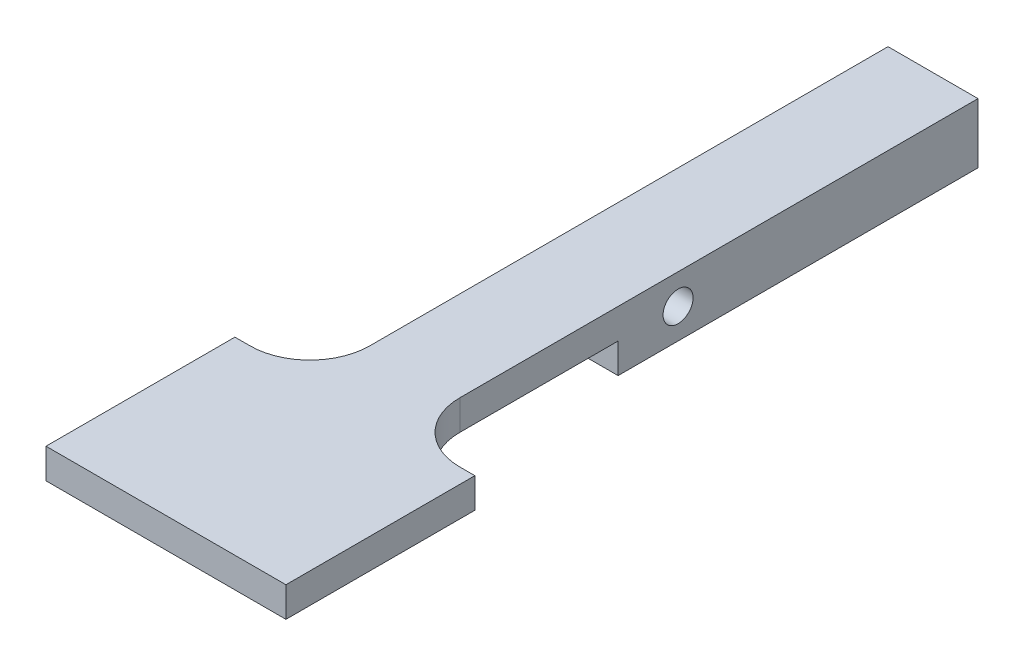
ISO-10303-21;
HEADER;
FILE_DESCRIPTION(('STEP AP214'),'2;1');
FILE_NAME('part.step','',(''),(''),'','','');
FILE_SCHEMA(('AUTOMOTIVE_DESIGN { 1 0 10303 214 1 1 1 1 }'));
ENDSEC;
DATA;
#1=APPLICATION_CONTEXT('core data for automotive mechanical design processes');
#2=APPLICATION_PROTOCOL_DEFINITION('international standard','automotive_design',2000,#1);
#3=PRODUCT_CONTEXT('',#1,'mechanical');
#4=PRODUCT('Part','Part','',(#3));
#5=PRODUCT_RELATED_PRODUCT_CATEGORY('part','',(#4));
#6=PRODUCT_DEFINITION_FORMATION('','',#4);
#7=PRODUCT_DEFINITION_CONTEXT('part definition',#1,'design');
#8=PRODUCT_DEFINITION('design','',#6,#7);
#9=PRODUCT_DEFINITION_SHAPE('','',#8);
#10=(LENGTH_UNIT() NAMED_UNIT(*) SI_UNIT(.MILLI.,.METRE.));
#11=(NAMED_UNIT(*) PLANE_ANGLE_UNIT() SI_UNIT($,.RADIAN.));
#12=(NAMED_UNIT(*) SI_UNIT($,.STERADIAN.) SOLID_ANGLE_UNIT());
#13=UNCERTAINTY_MEASURE_WITH_UNIT(LENGTH_MEASURE(1.E-05),#10,'distance_accuracy_value','');
#14=(GEOMETRIC_REPRESENTATION_CONTEXT(3) GLOBAL_UNCERTAINTY_ASSIGNED_CONTEXT((#13)) GLOBAL_UNIT_ASSIGNED_CONTEXT((#10,
#11,#12)) REPRESENTATION_CONTEXT('',''));
#15=CARTESIAN_POINT('',(0.,0.,0.));
#16=DIRECTION('',(0.,0.,1.));
#17=DIRECTION('',(1.,0.,0.));
#18=AXIS2_PLACEMENT_3D('',#15,#16,#17);
#19=CARTESIAN_POINT('',(9.525,0.,0.));
#20=DIRECTION('',(1.,0.,0.));
#21=DIRECTION('',(0.,0.,-1.));
#22=AXIS2_PLACEMENT_3D('',#19,#20,#21);
#23=PLANE('',#22);
#24=CARTESIAN_POINT('',(9.525,-1.5875,31.75));
#25=DIRECTION('',(1.,0.,0.));
#26=DIRECTION('',(0.,0.,-1.));
#27=AXIS2_PLACEMENT_3D('',#24,#25,#26);
#28=CIRCLE('',#27,1.5875);
#29=CARTESIAN_POINT('',(9.525,-1.5875,30.1625));
#30=VERTEX_POINT('',#29);
#31=EDGE_CURVE('E159',#30,#30,#28,.T.);
#32=ORIENTED_EDGE('',*,*,#31,.F.);
#33=EDGE_LOOP('',(#32));
#34=FACE_BOUND('',#33,.T.);
#35=DIRECTION('',(0.,0.,-1.));
#36=VECTOR('',#35,1.);
#37=CARTESIAN_POINT('',(9.525,1.5875,0.));
#38=LINE('',#37,#36);
#39=CARTESIAN_POINT('',(9.525,1.5875,54.85));
#40=VERTEX_POINT('',#39);
#41=CARTESIAN_POINT('',(9.525,1.5875,0.));
#42=VERTEX_POINT('',#41);
#43=EDGE_CURVE('E169',#40,#42,#38,.T.);
#44=ORIENTED_EDGE('',*,*,#43,.F.);
#45=DIRECTION('',(0.,-1.,0.));
#46=VECTOR('',#45,1.);
#47=CARTESIAN_POINT('',(9.525,0.,54.85));
#48=LINE('',#47,#46);
#49=CARTESIAN_POINT('',(9.525,-1.58750000000001,54.85));
#50=VERTEX_POINT('',#49);
#51=EDGE_CURVE('E202',#40,#50,#48,.T.);
#52=ORIENTED_EDGE('',*,*,#51,.T.);
#53=DIRECTION('',(0.,0.,1.));
#54=VECTOR('',#53,1.);
#55=CARTESIAN_POINT('',(9.525,-1.5875,0.));
#56=LINE('',#55,#54);
#57=CARTESIAN_POINT('',(9.525,-1.5875,38.1));
#58=VERTEX_POINT('',#57);
#59=EDGE_CURVE('E171',#58,#50,#56,.T.);
#60=ORIENTED_EDGE('',*,*,#59,.F.);
#61=DIRECTION('',(0.,-1.,0.));
#62=VECTOR('',#61,1.);
#63=CARTESIAN_POINT('',(9.525,0.,38.1));
#64=LINE('',#63,#62);
#65=CARTESIAN_POINT('',(9.525,-4.7625,38.1));
#66=VERTEX_POINT('',#65);
#67=EDGE_CURVE('E173',#58,#66,#64,.T.);
#68=ORIENTED_EDGE('',*,*,#67,.T.);
#69=DIRECTION('',(0.,0.,-1.));
#70=VECTOR('',#69,1.);
#71=CARTESIAN_POINT('',(9.525,-4.7625,0.));
#72=LINE('',#71,#70);
#73=CARTESIAN_POINT('',(9.525,-4.7625,0.));
#74=VERTEX_POINT('',#73);
#75=EDGE_CURVE('E162',#66,#74,#72,.T.);
#76=ORIENTED_EDGE('',*,*,#75,.T.);
#77=DIRECTION('',(0.,1.,0.));
#78=VECTOR('',#77,1.);
#79=CARTESIAN_POINT('',(9.525,0.,0.));
#80=LINE('',#79,#78);
#81=EDGE_CURVE('E166',#74,#42,#80,.T.);
#82=ORIENTED_EDGE('',*,*,#81,.T.);
#83=EDGE_LOOP('',(#44,#52,#60,#68,#76,#82));
#84=FACE_BOUND('',#83,.T.);
#85=ADVANCED_FACE('F38',(#34,#84),#23,.T.);
#86=CARTESIAN_POINT('',(0.,0.,0.));
#87=DIRECTION('',(1.,0.,0.));
#88=DIRECTION('',(0.,0.,-1.));
#89=AXIS2_PLACEMENT_3D('',#86,#87,#88);
#90=PLANE('',#89);
#91=CARTESIAN_POINT('',(0.,-1.5875,31.75));
#92=DIRECTION('',(1.,0.,0.));
#93=DIRECTION('',(0.,0.,-1.));
#94=AXIS2_PLACEMENT_3D('',#91,#92,#93);
#95=CIRCLE('',#94,1.5875);
#96=CARTESIAN_POINT('',(0.,-1.5875,30.1625));
#97=VERTEX_POINT('',#96);
#98=EDGE_CURVE('E150',#97,#97,#95,.T.);
#99=ORIENTED_EDGE('',*,*,#98,.T.);
#100=EDGE_LOOP('',(#99));
#101=FACE_BOUND('',#100,.T.);
#102=DIRECTION('',(0.,0.,1.));
#103=VECTOR('',#102,1.);
#104=CARTESIAN_POINT('',(0.,-1.5875,0.));
#105=LINE('',#104,#103);
#106=CARTESIAN_POINT('',(0.,-1.5875,38.1));
#107=VERTEX_POINT('',#106);
#108=CARTESIAN_POINT('',(0.,-1.58750000000001,54.85));
#109=VERTEX_POINT('',#108);
#110=EDGE_CURVE('E183',#107,#109,#105,.T.);
#111=ORIENTED_EDGE('',*,*,#110,.T.);
#112=DIRECTION('',(0.,-1.,0.));
#113=VECTOR('',#112,1.);
#114=CARTESIAN_POINT('',(0.,1.5875,54.85));
#115=LINE('',#114,#113);
#116=CARTESIAN_POINT('',(0.,1.5875,54.85));
#117=VERTEX_POINT('',#116);
#118=EDGE_CURVE('E200',#109,#117,#115,.F.);
#119=ORIENTED_EDGE('',*,*,#118,.T.);
#120=DIRECTION('',(0.,0.,-1.));
#121=VECTOR('',#120,1.);
#122=CARTESIAN_POINT('',(0.,1.5875,0.));
#123=LINE('',#122,#121);
#124=CARTESIAN_POINT('',(0.,1.5875,0.));
#125=VERTEX_POINT('',#124);
#126=EDGE_CURVE('E181',#117,#125,#123,.T.);
#127=ORIENTED_EDGE('',*,*,#126,.T.);
#128=DIRECTION('',(0.,1.,0.));
#129=VECTOR('',#128,1.);
#130=CARTESIAN_POINT('',(0.,0.,0.));
#131=LINE('',#130,#129);
#132=CARTESIAN_POINT('',(0.,-4.7625,0.));
#133=VERTEX_POINT('',#132);
#134=EDGE_CURVE('E178',#133,#125,#131,.T.);
#135=ORIENTED_EDGE('',*,*,#134,.F.);
#136=DIRECTION('',(0.,0.,-1.));
#137=VECTOR('',#136,1.);
#138=CARTESIAN_POINT('',(0.,-4.7625,0.));
#139=LINE('',#138,#137);
#140=CARTESIAN_POINT('',(0.,-4.7625,38.1));
#141=VERTEX_POINT('',#140);
#142=EDGE_CURVE('E153',#141,#133,#139,.T.);
#143=ORIENTED_EDGE('',*,*,#142,.F.);
#144=DIRECTION('',(0.,-1.,0.));
#145=VECTOR('',#144,1.);
#146=CARTESIAN_POINT('',(0.,0.,38.1));
#147=LINE('',#146,#145);
#148=EDGE_CURVE('E163',#107,#141,#147,.T.);
#149=ORIENTED_EDGE('',*,*,#148,.F.);
#150=EDGE_LOOP('',(#111,#119,#127,#135,#143,#149));
#151=FACE_BOUND('',#150,.T.);
#152=ADVANCED_FACE('F230',(#101,#151),#90,.F.);
#153=CARTESIAN_POINT('',(9.525,-4.7625,0.));
#154=DIRECTION('',(0.,1.,0.));
#155=DIRECTION('',(0.,0.,1.));
#156=AXIS2_PLACEMENT_3D('',#153,#154,#155);
#157=PLANE('',#156);
#158=ORIENTED_EDGE('',*,*,#142,.T.);
#159=DIRECTION('',(-1.,0.,0.));
#160=VECTOR('',#159,1.);
#161=CARTESIAN_POINT('',(9.525,-4.7625,0.));
#162=LINE('',#161,#160);
#163=EDGE_CURVE('E194',#74,#133,#162,.T.);
#164=ORIENTED_EDGE('',*,*,#163,.F.);
#165=ORIENTED_EDGE('',*,*,#75,.F.);
#166=DIRECTION('',(-1.,0.,0.));
#167=VECTOR('',#166,1.);
#168=CARTESIAN_POINT('',(9.525,-4.7625,38.1));
#169=LINE('',#168,#167);
#170=EDGE_CURVE('E174',#66,#141,#169,.T.);
#171=ORIENTED_EDGE('',*,*,#170,.T.);
#172=EDGE_LOOP('',(#158,#164,#165,#171));
#173=FACE_BOUND('',#172,.T.);
#174=ADVANCED_FACE('F238',(#173),#157,.F.);
#175=CARTESIAN_POINT('',(9.525,0.,0.));
#176=DIRECTION('',(0.,0.,1.));
#177=DIRECTION('',(0.,-1.,0.));
#178=AXIS2_PLACEMENT_3D('',#175,#176,#177);
#179=PLANE('',#178);
#180=ORIENTED_EDGE('',*,*,#134,.T.);
#181=DIRECTION('',(-1.,0.,0.));
#182=VECTOR('',#181,1.);
#183=CARTESIAN_POINT('',(9.525,1.5875,0.));
#184=LINE('',#183,#182);
#185=EDGE_CURVE('E191',#42,#125,#184,.T.);
#186=ORIENTED_EDGE('',*,*,#185,.F.);
#187=ORIENTED_EDGE('',*,*,#81,.F.);
#188=ORIENTED_EDGE('',*,*,#163,.T.);
#189=EDGE_LOOP('',(#180,#186,#187,#188));
#190=FACE_BOUND('',#189,.T.);
#191=ADVANCED_FACE('F285',(#190),#179,.F.);
#192=CARTESIAN_POINT('',(9.525,1.5875,0.));
#193=DIRECTION('',(0.,1.,0.));
#194=DIRECTION('',(0.,0.,1.));
#195=AXIS2_PLACEMENT_3D('',#192,#193,#194);
#196=PLANE('',#195);
#197=DIRECTION('',(-1.,0.,0.));
#198=VECTOR('',#197,1.);
#199=CARTESIAN_POINT('',(17.4625,1.5875,61.2));
#200=LINE('',#199,#198);
#201=CARTESIAN_POINT('',(17.4625,1.5875,61.2));
#202=VERTEX_POINT('',#201);
#203=CARTESIAN_POINT('',(15.875,1.5875,61.2));
#204=VERTEX_POINT('',#203);
#205=EDGE_CURVE('E221',#202,#204,#200,.T.);
#206=ORIENTED_EDGE('',*,*,#205,.T.);
#207=CARTESIAN_POINT('',(15.875,1.5875,54.85));
#208=DIRECTION('',(0.,1.,0.));
#209=DIRECTION('',(0.,0.,1.));
#210=AXIS2_PLACEMENT_3D('',#207,#208,#209);
#211=CIRCLE('',#210,6.35);
#212=EDGE_CURVE('E11',#204,#40,#211,.F.);
#213=ORIENTED_EDGE('',*,*,#212,.T.);
#214=ORIENTED_EDGE('',*,*,#43,.T.);
#215=ORIENTED_EDGE('',*,*,#185,.T.);
#216=ORIENTED_EDGE('',*,*,#126,.F.);
#217=CARTESIAN_POINT('',(-6.35,1.5875,54.85));
#218=DIRECTION('',(0.,1.,0.));
#219=DIRECTION('',(0.,0.,1.));
#220=AXIS2_PLACEMENT_3D('',#217,#218,#219);
#221=CIRCLE('',#220,6.35);
#222=CARTESIAN_POINT('',(-6.35,1.5875,61.2));
#223=VERTEX_POINT('',#222);
#224=EDGE_CURVE('E208',#117,#223,#221,.F.);
#225=ORIENTED_EDGE('',*,*,#224,.T.);
#226=CARTESIAN_POINT('',(-7.9375,1.5875,61.2));
#227=VERTEX_POINT('',#226);
#228=EDGE_CURVE('E212',#223,#227,#200,.T.);
#229=ORIENTED_EDGE('',*,*,#228,.T.);
#230=DIRECTION('',(0.,0.,1.));
#231=VECTOR('',#230,1.);
#232=CARTESIAN_POINT('',(-7.9375,1.58750000000001,0.));
#233=LINE('',#232,#231);
#234=CARTESIAN_POINT('',(-7.9375,1.5875,81.2));
#235=VERTEX_POINT('',#234);
#236=EDGE_CURVE('E149',#227,#235,#233,.T.);
#237=ORIENTED_EDGE('',*,*,#236,.T.);
#238=DIRECTION('',(-1.,0.,0.));
#239=VECTOR('',#238,1.);
#240=CARTESIAN_POINT('',(17.4625,1.5875,81.2));
#241=LINE('',#240,#239);
#242=CARTESIAN_POINT('',(17.4625,1.5875,81.2));
#243=VERTEX_POINT('',#242);
#244=EDGE_CURVE('E131',#243,#235,#241,.T.);
#245=ORIENTED_EDGE('',*,*,#244,.F.);
#246=DIRECTION('',(0.,0.,1.));
#247=VECTOR('',#246,1.);
#248=CARTESIAN_POINT('',(17.4625,1.58750000000001,0.));
#249=LINE('',#248,#247);
#250=EDGE_CURVE('E138',#202,#243,#249,.T.);
#251=ORIENTED_EDGE('',*,*,#250,.F.);
#252=EDGE_LOOP('',(#206,#213,#214,#215,#216,#225,#229,#237,#245,#251));
#253=FACE_BOUND('',#252,.T.);
#254=ADVANCED_FACE('F147',(#253),#196,.T.);
#255=CARTESIAN_POINT('',(9.525,-1.5875,0.));
#256=DIRECTION('',(0.,-1.,0.));
#257=DIRECTION('',(0.,0.,-1.));
#258=AXIS2_PLACEMENT_3D('',#255,#256,#257);
#259=PLANE('',#258);
#260=DIRECTION('',(-1.,0.,0.));
#261=VECTOR('',#260,1.);
#262=CARTESIAN_POINT('',(17.4625,-1.5875,61.2));
#263=LINE('',#262,#261);
#264=CARTESIAN_POINT('',(-6.35,-1.5875,61.2));
#265=VERTEX_POINT('',#264);
#266=CARTESIAN_POINT('',(-7.9375,-1.5875,61.2));
#267=VERTEX_POINT('',#266);
#268=EDGE_CURVE('E227',#265,#267,#263,.T.);
#269=ORIENTED_EDGE('',*,*,#268,.F.);
#270=CARTESIAN_POINT('',(-6.35,-1.58750000000001,54.85));
#271=DIRECTION('',(0.,-1.,0.));
#272=DIRECTION('',(0.,0.,-1.));
#273=AXIS2_PLACEMENT_3D('',#270,#271,#272);
#274=CIRCLE('',#273,6.35);
#275=EDGE_CURVE('E206',#265,#109,#274,.F.);
#276=ORIENTED_EDGE('',*,*,#275,.T.);
#277=ORIENTED_EDGE('',*,*,#110,.F.);
#278=DIRECTION('',(-1.,0.,0.));
#279=VECTOR('',#278,1.);
#280=CARTESIAN_POINT('',(9.525,-1.5875,38.1));
#281=LINE('',#280,#279);
#282=EDGE_CURVE('E189',#58,#107,#281,.T.);
#283=ORIENTED_EDGE('',*,*,#282,.F.);
#284=ORIENTED_EDGE('',*,*,#59,.T.);
#285=CARTESIAN_POINT('',(15.875,-1.58750000000001,54.85));
#286=DIRECTION('',(0.,-1.,0.));
#287=DIRECTION('',(0.,0.,-1.));
#288=AXIS2_PLACEMENT_3D('',#285,#286,#287);
#289=CIRCLE('',#288,6.35);
#290=CARTESIAN_POINT('',(15.875,-1.5875,61.2));
#291=VERTEX_POINT('',#290);
#292=EDGE_CURVE('E46',#50,#291,#289,.F.);
#293=ORIENTED_EDGE('',*,*,#292,.T.);
#294=CARTESIAN_POINT('',(17.4625,-1.5875,61.2));
#295=VERTEX_POINT('',#294);
#296=EDGE_CURVE('E155',#295,#291,#263,.T.);
#297=ORIENTED_EDGE('',*,*,#296,.F.);
#298=DIRECTION('',(0.,0.,-1.));
#299=VECTOR('',#298,1.);
#300=CARTESIAN_POINT('',(17.4625,-1.5875,0.));
#301=LINE('',#300,#299);
#302=CARTESIAN_POINT('',(17.4625,-1.58750000000001,81.2));
#303=VERTEX_POINT('',#302);
#304=EDGE_CURVE('E137',#303,#295,#301,.T.);
#305=ORIENTED_EDGE('',*,*,#304,.F.);
#306=DIRECTION('',(-1.,0.,0.));
#307=VECTOR('',#306,1.);
#308=CARTESIAN_POINT('',(17.4625,-1.58750000000001,81.2));
#309=LINE('',#308,#307);
#310=CARTESIAN_POINT('',(-7.9375,-1.58750000000001,81.2));
#311=VERTEX_POINT('',#310);
#312=EDGE_CURVE('E134',#303,#311,#309,.T.);
#313=ORIENTED_EDGE('',*,*,#312,.T.);
#314=DIRECTION('',(0.,0.,-1.));
#315=VECTOR('',#314,1.);
#316=CARTESIAN_POINT('',(-7.9375,-1.5875,0.));
#317=LINE('',#316,#315);
#318=EDGE_CURVE('E256',#311,#267,#317,.T.);
#319=ORIENTED_EDGE('',*,*,#318,.T.);
#320=EDGE_LOOP('',(#269,#276,#277,#283,#284,#293,#297,#305,#313,#319));
#321=FACE_BOUND('',#320,.T.);
#322=ADVANCED_FACE('F225',(#321),#259,.T.);
#323=CARTESIAN_POINT('',(9.525,-1.5875,31.75));
#324=DIRECTION('',(-1.,0.,0.));
#325=DIRECTION('',(0.,0.,1.));
#326=AXIS2_PLACEMENT_3D('',#323,#324,#325);
#327=CYLINDRICAL_SURFACE('',#326,1.5875);
#328=ORIENTED_EDGE('',*,*,#31,.T.);
#329=EDGE_LOOP('',(#328));
#330=FACE_BOUND('',#329,.T.);
#331=ORIENTED_EDGE('',*,*,#98,.F.);
#332=EDGE_LOOP('',(#331));
#333=FACE_BOUND('',#332,.T.);
#334=ADVANCED_FACE('F280',(#330,#333),#327,.F.);
#335=CARTESIAN_POINT('',(9.525,0.,38.1));
#336=DIRECTION('',(0.,0.,-1.));
#337=DIRECTION('',(-1.,0.,0.));
#338=AXIS2_PLACEMENT_3D('',#335,#336,#337);
#339=PLANE('',#338);
#340=ORIENTED_EDGE('',*,*,#148,.T.);
#341=ORIENTED_EDGE('',*,*,#170,.F.);
#342=ORIENTED_EDGE('',*,*,#67,.F.);
#343=ORIENTED_EDGE('',*,*,#282,.T.);
#344=EDGE_LOOP('',(#340,#341,#342,#343));
#345=FACE_BOUND('',#344,.T.);
#346=ADVANCED_FACE('F234',(#345),#339,.F.);
#347=CARTESIAN_POINT('',(17.4625,0.,61.2));
#348=DIRECTION('',(0.,0.,1.));
#349=DIRECTION('',(1.,0.,0.));
#350=AXIS2_PLACEMENT_3D('',#347,#348,#349);
#351=PLANE('',#350);
#352=ORIENTED_EDGE('',*,*,#228,.F.);
#353=DIRECTION('',(0.,-1.,0.));
#354=VECTOR('',#353,1.);
#355=CARTESIAN_POINT('',(-6.35,-1.5875,61.2));
#356=LINE('',#355,#354);
#357=EDGE_CURVE('E197',#223,#265,#356,.T.);
#358=ORIENTED_EDGE('',*,*,#357,.T.);
#359=ORIENTED_EDGE('',*,*,#268,.T.);
#360=DIRECTION('',(0.,1.,0.));
#361=VECTOR('',#360,1.);
#362=CARTESIAN_POINT('',(-7.9375,0.,61.2));
#363=LINE('',#362,#361);
#364=EDGE_CURVE('E145',#267,#227,#363,.T.);
#365=ORIENTED_EDGE('',*,*,#364,.T.);
#366=EDGE_LOOP('',(#352,#358,#359,#365));
#367=FACE_BOUND('',#366,.T.);
#368=ADVANCED_FACE('F218',(#367),#351,.F.);
#369=CARTESIAN_POINT('',(17.4625,0.,81.2));
#370=DIRECTION('',(0.,0.,-1.));
#371=DIRECTION('',(-1.,0.,0.));
#372=AXIS2_PLACEMENT_3D('',#369,#370,#371);
#373=PLANE('',#372);
#374=DIRECTION('',(0.,-1.,0.));
#375=VECTOR('',#374,1.);
#376=CARTESIAN_POINT('',(-7.9375,0.,81.2));
#377=LINE('',#376,#375);
#378=EDGE_CURVE('E255',#235,#311,#377,.T.);
#379=ORIENTED_EDGE('',*,*,#378,.T.);
#380=ORIENTED_EDGE('',*,*,#312,.F.);
#381=DIRECTION('',(0.,-1.,0.));
#382=VECTOR('',#381,1.);
#383=CARTESIAN_POINT('',(17.4625,0.,81.2));
#384=LINE('',#383,#382);
#385=EDGE_CURVE('E127',#243,#303,#384,.T.);
#386=ORIENTED_EDGE('',*,*,#385,.F.);
#387=ORIENTED_EDGE('',*,*,#244,.T.);
#388=EDGE_LOOP('',(#379,#380,#386,#387));
#389=FACE_BOUND('',#388,.T.);
#390=ADVANCED_FACE('F129',(#389),#373,.F.);
#391=ORIENTED_EDGE('',*,*,#296,.T.);
#392=DIRECTION('',(0.,-1.,0.));
#393=VECTOR('',#392,1.);
#394=CARTESIAN_POINT('',(15.875,0.,61.2));
#395=LINE('',#394,#393);
#396=EDGE_CURVE('E59',#291,#204,#395,.F.);
#397=ORIENTED_EDGE('',*,*,#396,.T.);
#398=ORIENTED_EDGE('',*,*,#205,.F.);
#399=DIRECTION('',(0.,1.,0.));
#400=VECTOR('',#399,1.);
#401=CARTESIAN_POINT('',(17.4625,0.,61.2));
#402=LINE('',#401,#400);
#403=EDGE_CURVE('E143',#295,#202,#402,.T.);
#404=ORIENTED_EDGE('',*,*,#403,.F.);
#405=EDGE_LOOP('',(#391,#397,#398,#404));
#406=FACE_BOUND('',#405,.T.);
#407=ADVANCED_FACE('F249',(#406),#351,.F.);
#408=CARTESIAN_POINT('',(17.4625,0.,0.));
#409=DIRECTION('',(1.,0.,0.));
#410=DIRECTION('',(0.,0.,-1.));
#411=AXIS2_PLACEMENT_3D('',#408,#409,#410);
#412=PLANE('',#411);
#413=ORIENTED_EDGE('',*,*,#250,.T.);
#414=ORIENTED_EDGE('',*,*,#385,.T.);
#415=ORIENTED_EDGE('',*,*,#304,.T.);
#416=ORIENTED_EDGE('',*,*,#403,.T.);
#417=EDGE_LOOP('',(#413,#414,#415,#416));
#418=FACE_BOUND('',#417,.T.);
#419=ADVANCED_FACE('F141',(#418),#412,.T.);
#420=CARTESIAN_POINT('',(-7.9375,0.,0.));
#421=DIRECTION('',(1.,0.,0.));
#422=DIRECTION('',(0.,0.,-1.));
#423=AXIS2_PLACEMENT_3D('',#420,#421,#422);
#424=PLANE('',#423);
#425=ORIENTED_EDGE('',*,*,#236,.F.);
#426=ORIENTED_EDGE('',*,*,#364,.F.);
#427=ORIENTED_EDGE('',*,*,#318,.F.);
#428=ORIENTED_EDGE('',*,*,#378,.F.);
#429=EDGE_LOOP('',(#425,#426,#427,#428));
#430=FACE_BOUND('',#429,.T.);
#431=ADVANCED_FACE('F258',(#430),#424,.F.);
#432=CARTESIAN_POINT('',(-6.35,0.,54.85));
#433=DIRECTION('',(0.,1.,0.));
#434=DIRECTION('',(0.,0.,1.));
#435=AXIS2_PLACEMENT_3D('',#432,#433,#434);
#436=CYLINDRICAL_SURFACE('',#435,6.35);
#437=ORIENTED_EDGE('',*,*,#224,.F.);
#438=ORIENTED_EDGE('',*,*,#118,.F.);
#439=ORIENTED_EDGE('',*,*,#275,.F.);
#440=ORIENTED_EDGE('',*,*,#357,.F.);
#441=EDGE_LOOP('',(#437,#438,#439,#440));
#442=FACE_BOUND('',#441,.T.);
#443=ADVANCED_FACE('F223',(#442),#436,.F.);
#444=CARTESIAN_POINT('',(15.875,0.,54.85));
#445=DIRECTION('',(0.,-1.,0.));
#446=DIRECTION('',(0.,0.,-1.));
#447=AXIS2_PLACEMENT_3D('',#444,#445,#446);
#448=CYLINDRICAL_SURFACE('',#447,6.35);
#449=ORIENTED_EDGE('',*,*,#212,.F.);
#450=ORIENTED_EDGE('',*,*,#396,.F.);
#451=ORIENTED_EDGE('',*,*,#292,.F.);
#452=ORIENTED_EDGE('',*,*,#51,.F.);
#453=EDGE_LOOP('',(#449,#450,#451,#452));
#454=FACE_BOUND('',#453,.T.);
#455=ADVANCED_FACE('F40',(#454),#448,.F.);
#456=CLOSED_SHELL('',(#85,#152,#174,#191,#254,#322,#334,#346,#368,#390,#407,#419,#431,#443,#455));
#457=MANIFOLD_SOLID_BREP('B2',#456);
#458=ADVANCED_BREP_SHAPE_REPRESENTATION('',(#18,#457),#14);
#459=SHAPE_DEFINITION_REPRESENTATION(#9,#458);
ENDSEC;
END-ISO-10303-21;
